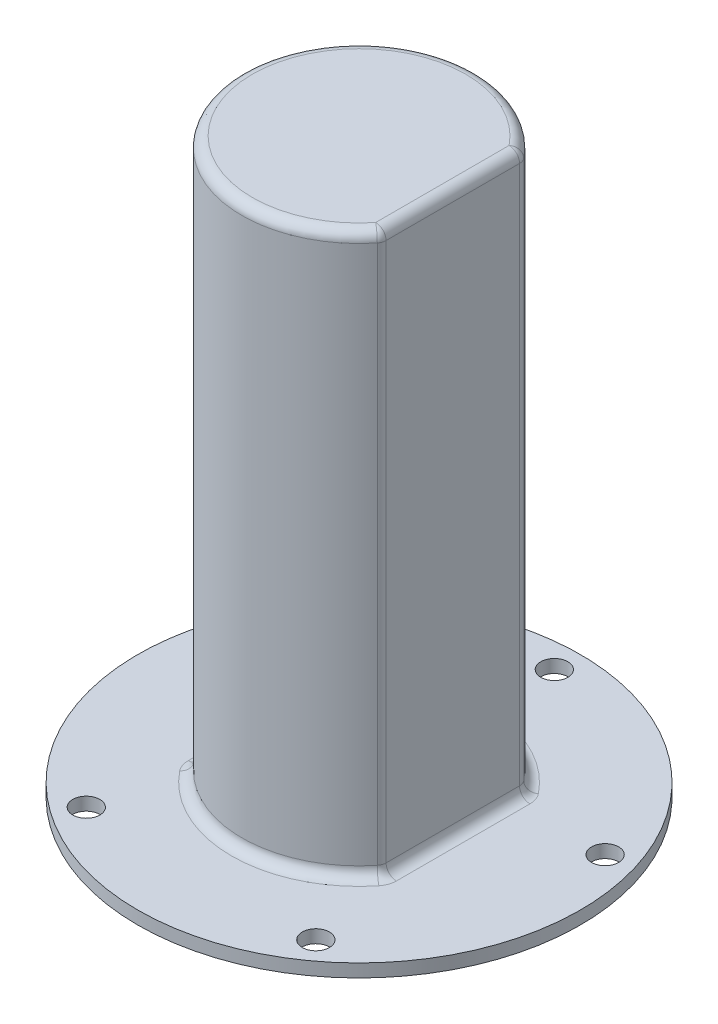
ISO-10303-21;
HEADER;
FILE_DESCRIPTION(('STEP AP214'),'2;1');
FILE_NAME('part.step','',(''),(''),'','','');
FILE_SCHEMA(('AUTOMOTIVE_DESIGN { 1 0 10303 214 1 1 1 1 }'));
ENDSEC;
DATA;
#1=APPLICATION_CONTEXT('core data for automotive mechanical design processes');
#2=APPLICATION_PROTOCOL_DEFINITION('international standard','automotive_design',2000,#1);
#3=PRODUCT_CONTEXT('',#1,'mechanical');
#4=PRODUCT('Part','Part','',(#3));
#5=PRODUCT_RELATED_PRODUCT_CATEGORY('part','',(#4));
#6=PRODUCT_DEFINITION_FORMATION('','',#4);
#7=PRODUCT_DEFINITION_CONTEXT('part definition',#1,'design');
#8=PRODUCT_DEFINITION('design','',#6,#7);
#9=PRODUCT_DEFINITION_SHAPE('','',#8);
#10=(LENGTH_UNIT() NAMED_UNIT(*) SI_UNIT(.MILLI.,.METRE.));
#11=(NAMED_UNIT(*) PLANE_ANGLE_UNIT() SI_UNIT($,.RADIAN.));
#12=(NAMED_UNIT(*) SI_UNIT($,.STERADIAN.) SOLID_ANGLE_UNIT());
#13=UNCERTAINTY_MEASURE_WITH_UNIT(LENGTH_MEASURE(1.E-05),#10,'distance_accuracy_value','');
#14=(GEOMETRIC_REPRESENTATION_CONTEXT(3) GLOBAL_UNCERTAINTY_ASSIGNED_CONTEXT((#13)) GLOBAL_UNIT_ASSIGNED_CONTEXT((#10,
#11,#12)) REPRESENTATION_CONTEXT('',''));
#15=CARTESIAN_POINT('',(0.,0.,0.));
#16=DIRECTION('',(0.,0.,1.));
#17=DIRECTION('',(1.,0.,0.));
#18=AXIS2_PLACEMENT_3D('',#15,#16,#17);
#19=CARTESIAN_POINT('',(0.,3.175,0.));
#20=DIRECTION('',(0.,1.,0.));
#21=DIRECTION('',(0.,0.,1.));
#22=AXIS2_PLACEMENT_3D('',#19,#20,#21);
#23=PLANE('',#22);
#24=CARTESIAN_POINT('',(45.2940665885567,3.175,-14.7169343571067));
#25=DIRECTION('',(0.,1.,0.));
#26=DIRECTION('',(0.,0.,1.));
#27=AXIS2_PLACEMENT_3D('',#24,#25,#26);
#28=CIRCLE('',#27,3.302);
#29=CARTESIAN_POINT('',(45.2940665885567,3.175,-11.4149343571067));
#30=VERTEX_POINT('',#29);
#31=EDGE_CURVE('E163',#30,#30,#28,.T.);
#32=ORIENTED_EDGE('',*,*,#31,.F.);
#33=EDGE_LOOP('',(#32));
#34=FACE_BOUND('',#33,.T.);
#35=CARTESIAN_POINT('',(0.,3.175,0.));
#36=DIRECTION('',(0.,1.,0.));
#37=DIRECTION('',(0.,0.,1.));
#38=AXIS2_PLACEMENT_3D('',#35,#36,#37);
#39=CIRCLE('',#38,53.975);
#40=CARTESIAN_POINT('',(0.,3.175,53.975));
#41=VERTEX_POINT('',#40);
#42=EDGE_CURVE('E175',#41,#41,#39,.T.);
#43=ORIENTED_EDGE('',*,*,#42,.T.);
#44=EDGE_LOOP('',(#43));
#45=FACE_BOUND('',#44,.T.);
#46=CARTESIAN_POINT('',(27.9932726404288,3.175,38.529434357107));
#47=DIRECTION('',(0.,1.,0.));
#48=DIRECTION('',(0.,0.,1.));
#49=AXIS2_PLACEMENT_3D('',#46,#47,#48);
#50=CIRCLE('',#49,3.302);
#51=CARTESIAN_POINT('',(27.9932726404288,3.175,41.831434357107));
#52=VERTEX_POINT('',#51);
#53=EDGE_CURVE('E157',#52,#52,#50,.T.);
#54=ORIENTED_EDGE('',*,*,#53,.F.);
#55=EDGE_LOOP('',(#54));
#56=FACE_BOUND('',#55,.T.);
#57=CARTESIAN_POINT('',(0.,3.175,-47.625));
#58=DIRECTION('',(0.,1.,0.));
#59=DIRECTION('',(0.,0.,1.));
#60=AXIS2_PLACEMENT_3D('',#57,#58,#59);
#61=CIRCLE('',#60,3.302);
#62=CARTESIAN_POINT('',(0.,3.175,-44.323));
#63=VERTEX_POINT('',#62);
#64=EDGE_CURVE('E169',#63,#63,#61,.T.);
#65=ORIENTED_EDGE('',*,*,#64,.F.);
#66=EDGE_LOOP('',(#65));
#67=FACE_BOUND('',#66,.T.);
#68=CARTESIAN_POINT('',(-27.9932726404294,3.175,38.5294343571066));
#69=DIRECTION('',(0.,1.,0.));
#70=DIRECTION('',(0.,0.,1.));
#71=AXIS2_PLACEMENT_3D('',#68,#69,#70);
#72=CIRCLE('',#71,3.302);
#73=CARTESIAN_POINT('',(-27.9932726404294,3.175,41.8314343571066));
#74=VERTEX_POINT('',#73);
#75=EDGE_CURVE('E147',#74,#74,#72,.T.);
#76=ORIENTED_EDGE('',*,*,#75,.F.);
#77=EDGE_LOOP('',(#76));
#78=FACE_BOUND('',#77,.T.);
#79=CARTESIAN_POINT('',(-45.2940665885565,3.175,-14.7169343571074));
#80=DIRECTION('',(0.,1.,0.));
#81=DIRECTION('',(0.,0.,1.));
#82=AXIS2_PLACEMENT_3D('',#79,#80,#81);
#83=CIRCLE('',#82,3.302);
#84=CARTESIAN_POINT('',(-47.5318559517014,3.175,-17.145));
#85=VERTEX_POINT('',#84);
#86=EDGE_CURVE('E140',#85,#85,#83,.T.);
#87=ORIENTED_EDGE('',*,*,#86,.F.);
#88=EDGE_LOOP('',(#87));
#89=FACE_BOUND('',#88,.T.);
#90=CARTESIAN_POINT('',(20.32,3.175,-16.2763271348299));
#91=DIRECTION('',(0.,1.,0.));
#92=DIRECTION('',(0.,0.,1.));
#93=AXIS2_PLACEMENT_3D('',#90,#91,#92);
#94=CIRCLE('',#93,5.08);
#95=CARTESIAN_POINT('',(25.4,3.175,-16.2763271348299));
#96=VERTEX_POINT('',#95);
#97=CARTESIAN_POINT('',(24.2848780487805,3.175,-19.452195844065));
#98=VERTEX_POINT('',#97);
#99=EDGE_CURVE('E215',#96,#98,#94,.T.);
#100=ORIENTED_EDGE('',*,*,#99,.F.);
#101=DIRECTION('',(0.,0.,-1.));
#102=VECTOR('',#101,1.);
#103=CARTESIAN_POINT('',(25.4,3.175,0.));
#104=LINE('',#103,#102);
#105=CARTESIAN_POINT('',(25.4,3.175,16.2763271348299));
#106=VERTEX_POINT('',#105);
#107=EDGE_CURVE('E213',#96,#106,#104,.F.);
#108=ORIENTED_EDGE('',*,*,#107,.T.);
#109=CARTESIAN_POINT('',(20.32,3.175,16.2763271348299));
#110=DIRECTION('',(0.,1.,0.));
#111=DIRECTION('',(0.,0.,1.));
#112=AXIS2_PLACEMENT_3D('',#109,#110,#111);
#113=CIRCLE('',#112,5.08);
#114=CARTESIAN_POINT('',(24.2848780487805,3.175,19.452195844065));
#115=VERTEX_POINT('',#114);
#116=EDGE_CURVE('E210',#115,#106,#113,.T.);
#117=ORIENTED_EDGE('',*,*,#116,.F.);
#118=CARTESIAN_POINT('',(0.,3.175,0.));
#119=DIRECTION('',(0.,1.,0.));
#120=DIRECTION('',(0.,0.,1.));
#121=AXIS2_PLACEMENT_3D('',#118,#119,#120);
#122=CIRCLE('',#121,31.115);
#123=CARTESIAN_POINT('',(-24.2848780487805,3.175,19.452195844065));
#124=VERTEX_POINT('',#123);
#125=EDGE_CURVE('E207',#115,#124,#122,.F.);
#126=ORIENTED_EDGE('',*,*,#125,.T.);
#127=CARTESIAN_POINT('',(-20.32,3.175,16.2763271348299));
#128=DIRECTION('',(0.,1.,0.));
#129=DIRECTION('',(0.,0.,1.));
#130=AXIS2_PLACEMENT_3D('',#127,#128,#129);
#131=CIRCLE('',#130,5.08);
#132=CARTESIAN_POINT('',(-25.4,3.175,16.2763271348299));
#133=VERTEX_POINT('',#132);
#134=EDGE_CURVE('E204',#133,#124,#131,.T.);
#135=ORIENTED_EDGE('',*,*,#134,.F.);
#136=DIRECTION('',(0.,0.,-1.));
#137=VECTOR('',#136,1.);
#138=CARTESIAN_POINT('',(-25.4,3.175,-17.145));
#139=LINE('',#138,#137);
#140=CARTESIAN_POINT('',(-25.4,3.175,-16.2763271348299));
#141=VERTEX_POINT('',#140);
#142=EDGE_CURVE('E200',#133,#141,#139,.T.);
#143=ORIENTED_EDGE('',*,*,#142,.T.);
#144=CARTESIAN_POINT('',(-20.32,3.175,-16.2763271348299));
#145=DIRECTION('',(0.,1.,0.));
#146=DIRECTION('',(0.,0.,1.));
#147=AXIS2_PLACEMENT_3D('',#144,#145,#146);
#148=CIRCLE('',#147,5.08);
#149=CARTESIAN_POINT('',(-24.2848780487805,3.175,-19.452195844065));
#150=VERTEX_POINT('',#149);
#151=EDGE_CURVE('E197',#150,#141,#148,.T.);
#152=ORIENTED_EDGE('',*,*,#151,.F.);
#153=CARTESIAN_POINT('',(0.,3.175,0.));
#154=DIRECTION('',(0.,1.,0.));
#155=DIRECTION('',(0.,0.,1.));
#156=AXIS2_PLACEMENT_3D('',#153,#154,#155);
#157=CIRCLE('',#156,31.115);
#158=EDGE_CURVE('E202',#150,#98,#157,.F.);
#159=ORIENTED_EDGE('',*,*,#158,.T.);
#160=EDGE_LOOP('',(#100,#108,#117,#126,#135,#143,#152,#159));
#161=FACE_BOUND('',#160,.T.);
#162=ADVANCED_FACE('F35',(#34,#45,#56,#67,#78,#89,#161),#23,.T.);
#163=CARTESIAN_POINT('',(0.,139.7,0.));
#164=DIRECTION('',(0.,-1.,0.));
#165=DIRECTION('',(0.,0.,-1.));
#166=AXIS2_PLACEMENT_3D('',#163,#164,#165);
#167=CYLINDRICAL_SURFACE('',#166,28.575);
#168=DIRECTION('',(0.,-1.,0.));
#169=VECTOR('',#168,1.);
#170=CARTESIAN_POINT('',(-22.3024390243902,139.7,-17.8642614894475));
#171=LINE('',#170,#169);
#172=CARTESIAN_POINT('',(-22.3024390243902,5.715,-17.8642614894475));
#173=VERTEX_POINT('',#172);
#174=CARTESIAN_POINT('',(-22.3024390243902,55.245,-17.8642614894475));
#175=VERTEX_POINT('',#174);
#176=EDGE_CURVE('E191',#173,#175,#171,.F.);
#177=ORIENTED_EDGE('',*,*,#176,.T.);
#178=CARTESIAN_POINT('',(0.,55.245,0.));
#179=DIRECTION('',(0.,1.,0.));
#180=DIRECTION('',(0.,0.,1.));
#181=AXIS2_PLACEMENT_3D('',#178,#179,#180);
#182=CIRCLE('',#181,28.575);
#183=CARTESIAN_POINT('',(-22.3024390243902,55.245,17.8642614894475));
#184=VERTEX_POINT('',#183);
#185=EDGE_CURVE('E195',#175,#184,#182,.T.);
#186=ORIENTED_EDGE('',*,*,#185,.T.);
#187=DIRECTION('',(0.,-1.,0.));
#188=VECTOR('',#187,1.);
#189=CARTESIAN_POINT('',(-22.3024390243902,139.7,17.8642614894475));
#190=LINE('',#189,#188);
#191=CARTESIAN_POINT('',(-22.3024390243902,5.715,17.8642614894475));
#192=VERTEX_POINT('',#191);
#193=EDGE_CURVE('E193',#184,#192,#190,.T.);
#194=ORIENTED_EDGE('',*,*,#193,.T.);
#195=CARTESIAN_POINT('',(0.,5.715,0.));
#196=DIRECTION('',(0.,1.,0.));
#197=DIRECTION('',(0.,0.,1.));
#198=AXIS2_PLACEMENT_3D('',#195,#196,#197);
#199=CIRCLE('',#198,28.575);
#200=CARTESIAN_POINT('',(22.3024390243902,5.715,17.8642614894475));
#201=VERTEX_POINT('',#200);
#202=EDGE_CURVE('E188',#192,#201,#199,.T.);
#203=ORIENTED_EDGE('',*,*,#202,.T.);
#204=DIRECTION('',(0.,-1.,0.));
#205=VECTOR('',#204,1.);
#206=CARTESIAN_POINT('',(22.3024390243902,139.7,17.8642614894475));
#207=LINE('',#206,#205);
#208=CARTESIAN_POINT('',(22.3024390243902,137.16,17.8642614894475));
#209=VERTEX_POINT('',#208);
#210=EDGE_CURVE('E184',#201,#209,#207,.F.);
#211=ORIENTED_EDGE('',*,*,#210,.T.);
#212=CARTESIAN_POINT('',(0.,137.16,0.));
#213=DIRECTION('',(0.,1.,0.));
#214=DIRECTION('',(0.,0.,1.));
#215=AXIS2_PLACEMENT_3D('',#212,#213,#214);
#216=CIRCLE('',#215,28.575);
#217=CARTESIAN_POINT('',(22.3024390243902,137.16,-17.8642614894475));
#218=VERTEX_POINT('',#217);
#219=EDGE_CURVE('E178',#209,#218,#216,.F.);
#220=ORIENTED_EDGE('',*,*,#219,.T.);
#221=DIRECTION('',(0.,-1.,0.));
#222=VECTOR('',#221,1.);
#223=CARTESIAN_POINT('',(22.3024390243902,139.7,-17.8642614894475));
#224=LINE('',#223,#222);
#225=CARTESIAN_POINT('',(22.3024390243902,5.715,-17.8642614894475));
#226=VERTEX_POINT('',#225);
#227=EDGE_CURVE('E182',#218,#226,#224,.T.);
#228=ORIENTED_EDGE('',*,*,#227,.T.);
#229=CARTESIAN_POINT('',(0.,5.715,0.));
#230=DIRECTION('',(0.,1.,0.));
#231=DIRECTION('',(0.,0.,1.));
#232=AXIS2_PLACEMENT_3D('',#229,#230,#231);
#233=CIRCLE('',#232,28.575);
#234=EDGE_CURVE('E186',#226,#173,#233,.T.);
#235=ORIENTED_EDGE('',*,*,#234,.T.);
#236=EDGE_LOOP('',(#177,#186,#194,#203,#211,#220,#228,#235));
#237=FACE_BOUND('',#236,.T.);
#238=ADVANCED_FACE('F267',(#237),#167,.T.);
#239=CARTESIAN_POINT('',(0.,0.,0.));
#240=DIRECTION('',(0.,1.,0.));
#241=DIRECTION('',(0.,0.,1.));
#242=AXIS2_PLACEMENT_3D('',#239,#240,#241);
#243=PLANE('',#242);
#244=CARTESIAN_POINT('',(-27.9932726404294,0.,38.5294343571066));
#245=DIRECTION('',(0.,1.,0.));
#246=DIRECTION('',(0.,0.,1.));
#247=AXIS2_PLACEMENT_3D('',#244,#245,#246);
#248=CIRCLE('',#247,3.302);
#249=CARTESIAN_POINT('',(-27.9932726404294,0.,41.8314343571066));
#250=VERTEX_POINT('',#249);
#251=EDGE_CURVE('E143',#250,#250,#248,.T.);
#252=ORIENTED_EDGE('',*,*,#251,.T.);
#253=EDGE_LOOP('',(#252));
#254=FACE_BOUND('',#253,.T.);
#255=CARTESIAN_POINT('',(45.2940665885567,0.,-14.7169343571067));
#256=DIRECTION('',(0.,1.,0.));
#257=DIRECTION('',(0.,0.,1.));
#258=AXIS2_PLACEMENT_3D('',#255,#256,#257);
#259=CIRCLE('',#258,3.302);
#260=CARTESIAN_POINT('',(45.2940665885567,0.,-11.4149343571067));
#261=VERTEX_POINT('',#260);
#262=EDGE_CURVE('E160',#261,#261,#259,.T.);
#263=ORIENTED_EDGE('',*,*,#262,.T.);
#264=EDGE_LOOP('',(#263));
#265=FACE_BOUND('',#264,.T.);
#266=CARTESIAN_POINT('',(0.,0.,0.));
#267=DIRECTION('',(0.,1.,0.));
#268=DIRECTION('',(0.,0.,1.));
#269=AXIS2_PLACEMENT_3D('',#266,#267,#268);
#270=CIRCLE('',#269,53.975);
#271=CARTESIAN_POINT('',(0.,0.,53.975));
#272=VERTEX_POINT('',#271);
#273=EDGE_CURVE('E172',#272,#272,#270,.T.);
#274=ORIENTED_EDGE('',*,*,#273,.F.);
#275=EDGE_LOOP('',(#274));
#276=FACE_BOUND('',#275,.T.);
#277=CARTESIAN_POINT('',(0.,0.,-47.625));
#278=DIRECTION('',(0.,1.,0.));
#279=DIRECTION('',(0.,0.,1.));
#280=AXIS2_PLACEMENT_3D('',#277,#278,#279);
#281=CIRCLE('',#280,3.302);
#282=CARTESIAN_POINT('',(0.,0.,-44.323));
#283=VERTEX_POINT('',#282);
#284=EDGE_CURVE('E166',#283,#283,#281,.T.);
#285=ORIENTED_EDGE('',*,*,#284,.T.);
#286=EDGE_LOOP('',(#285));
#287=FACE_BOUND('',#286,.T.);
#288=CARTESIAN_POINT('',(27.9932726404288,0.,38.529434357107));
#289=DIRECTION('',(0.,1.,0.));
#290=DIRECTION('',(0.,0.,1.));
#291=AXIS2_PLACEMENT_3D('',#288,#289,#290);
#292=CIRCLE('',#291,3.302);
#293=CARTESIAN_POINT('',(27.9932726404288,0.,41.831434357107));
#294=VERTEX_POINT('',#293);
#295=EDGE_CURVE('E155',#294,#294,#292,.T.);
#296=ORIENTED_EDGE('',*,*,#295,.T.);
#297=EDGE_LOOP('',(#296));
#298=FACE_BOUND('',#297,.T.);
#299=CARTESIAN_POINT('',(-45.2940665885565,0.,-14.7169343571074));
#300=DIRECTION('',(0.,1.,0.));
#301=DIRECTION('',(0.,0.,1.));
#302=AXIS2_PLACEMENT_3D('',#299,#300,#301);
#303=CIRCLE('',#302,3.302);
#304=CARTESIAN_POINT('',(-45.2940665885565,0.,-11.4149343571074));
#305=VERTEX_POINT('',#304);
#306=EDGE_CURVE('E144',#305,#305,#303,.T.);
#307=ORIENTED_EDGE('',*,*,#306,.T.);
#308=EDGE_LOOP('',(#307));
#309=FACE_BOUND('',#308,.T.);
#310=ADVANCED_FACE('F270',(#254,#265,#276,#287,#298,#309),#243,.F.);
#311=CARTESIAN_POINT('',(0.,3.175,0.));
#312=DIRECTION('',(0.,-1.,0.));
#313=DIRECTION('',(0.,0.,-1.));
#314=AXIS2_PLACEMENT_3D('',#311,#312,#313);
#315=CYLINDRICAL_SURFACE('',#314,53.975);
#316=ORIENTED_EDGE('',*,*,#42,.F.);
#317=EDGE_LOOP('',(#316));
#318=FACE_BOUND('',#317,.T.);
#319=ORIENTED_EDGE('',*,*,#273,.T.);
#320=EDGE_LOOP('',(#319));
#321=FACE_BOUND('',#320,.T.);
#322=ADVANCED_FACE('F289',(#318,#321),#315,.T.);
#323=CARTESIAN_POINT('',(0.,3.175,-47.625));
#324=DIRECTION('',(0.,-1.,0.));
#325=DIRECTION('',(0.,0.,-1.));
#326=AXIS2_PLACEMENT_3D('',#323,#324,#325);
#327=CYLINDRICAL_SURFACE('',#326,3.302);
#328=ORIENTED_EDGE('',*,*,#64,.T.);
#329=EDGE_LOOP('',(#328));
#330=FACE_BOUND('',#329,.T.);
#331=ORIENTED_EDGE('',*,*,#284,.F.);
#332=EDGE_LOOP('',(#331));
#333=FACE_BOUND('',#332,.T.);
#334=ADVANCED_FACE('F285',(#330,#333),#327,.F.);
#335=CARTESIAN_POINT('',(45.2940665885567,3.175,-14.7169343571067));
#336=DIRECTION('',(0.,-1.,0.));
#337=DIRECTION('',(0.,0.,-1.));
#338=AXIS2_PLACEMENT_3D('',#335,#336,#337);
#339=CYLINDRICAL_SURFACE('',#338,3.302);
#340=ORIENTED_EDGE('',*,*,#31,.T.);
#341=EDGE_LOOP('',(#340));
#342=FACE_BOUND('',#341,.T.);
#343=ORIENTED_EDGE('',*,*,#262,.F.);
#344=EDGE_LOOP('',(#343));
#345=FACE_BOUND('',#344,.T.);
#346=ADVANCED_FACE('F281',(#342,#345),#339,.F.);
#347=CARTESIAN_POINT('',(27.9932726404288,3.175,38.529434357107));
#348=DIRECTION('',(0.,-1.,0.));
#349=DIRECTION('',(0.,0.,-1.));
#350=AXIS2_PLACEMENT_3D('',#347,#348,#349);
#351=CYLINDRICAL_SURFACE('',#350,3.302);
#352=ORIENTED_EDGE('',*,*,#53,.T.);
#353=EDGE_LOOP('',(#352));
#354=FACE_BOUND('',#353,.T.);
#355=ORIENTED_EDGE('',*,*,#295,.F.);
#356=EDGE_LOOP('',(#355));
#357=FACE_BOUND('',#356,.T.);
#358=ADVANCED_FACE('F277',(#354,#357),#351,.F.);
#359=CARTESIAN_POINT('',(-27.9932726404294,3.175,38.5294343571066));
#360=DIRECTION('',(0.,-1.,0.));
#361=DIRECTION('',(0.,0.,-1.));
#362=AXIS2_PLACEMENT_3D('',#359,#360,#361);
#363=CYLINDRICAL_SURFACE('',#362,3.302);
#364=ORIENTED_EDGE('',*,*,#75,.T.);
#365=EDGE_LOOP('',(#364));
#366=FACE_BOUND('',#365,.T.);
#367=ORIENTED_EDGE('',*,*,#251,.F.);
#368=EDGE_LOOP('',(#367));
#369=FACE_BOUND('',#368,.T.);
#370=ADVANCED_FACE('F274',(#366,#369),#363,.F.);
#371=CARTESIAN_POINT('',(-45.2940665885565,3.175,-14.7169343571074));
#372=DIRECTION('',(0.,-1.,0.));
#373=DIRECTION('',(0.,0.,-1.));
#374=AXIS2_PLACEMENT_3D('',#371,#372,#373);
#375=CYLINDRICAL_SURFACE('',#374,3.302);
#376=ORIENTED_EDGE('',*,*,#86,.T.);
#377=EDGE_LOOP('',(#376));
#378=FACE_BOUND('',#377,.T.);
#379=ORIENTED_EDGE('',*,*,#306,.F.);
#380=EDGE_LOOP('',(#379));
#381=FACE_BOUND('',#380,.T.);
#382=ADVANCED_FACE('F265',(#378,#381),#375,.F.);
#383=CARTESIAN_POINT('',(0.,139.7,0.));
#384=DIRECTION('',(0.,1.,0.));
#385=DIRECTION('',(0.,0.,1.));
#386=AXIS2_PLACEMENT_3D('',#383,#384,#385);
#387=PLANE('',#386);
#388=CARTESIAN_POINT('',(0.,139.7,0.));
#389=DIRECTION('',(0.,1.,0.));
#390=DIRECTION('',(0.,0.,1.));
#391=AXIS2_PLACEMENT_3D('',#388,#389,#390);
#392=CIRCLE('',#391,26.035);
#393=CARTESIAN_POINT('',(20.32,139.7,-16.2763271348299));
#394=VERTEX_POINT('',#393);
#395=CARTESIAN_POINT('',(20.32,139.7,16.2763271348299));
#396=VERTEX_POINT('',#395);
#397=EDGE_CURVE('E233',#394,#396,#392,.T.);
#398=ORIENTED_EDGE('',*,*,#397,.T.);
#399=DIRECTION('',(0.,0.,1.));
#400=VECTOR('',#399,1.);
#401=CARTESIAN_POINT('',(20.32,139.7,-17.145));
#402=LINE('',#401,#400);
#403=EDGE_CURVE('E235',#396,#394,#402,.F.);
#404=ORIENTED_EDGE('',*,*,#403,.T.);
#405=EDGE_LOOP('',(#398,#404));
#406=FACE_BOUND('',#405,.T.);
#407=ADVANCED_FACE('F261',(#406),#387,.T.);
#408=CARTESIAN_POINT('',(22.86,-49.8540887247113,-17.145));
#409=DIRECTION('',(-1.,0.,0.));
#410=DIRECTION('',(0.,0.,1.));
#411=AXIS2_PLACEMENT_3D('',#408,#409,#410);
#412=PLANE('',#411);
#413=DIRECTION('',(0.,-1.,0.));
#414=VECTOR('',#413,1.);
#415=CARTESIAN_POINT('',(22.86,-49.8540887247113,16.2763271348299));
#416=LINE('',#415,#414);
#417=CARTESIAN_POINT('',(22.86,137.16,16.2763271348299));
#418=VERTEX_POINT('',#417);
#419=CARTESIAN_POINT('',(22.86,5.715,16.2763271348299));
#420=VERTEX_POINT('',#419);
#421=EDGE_CURVE('E222',#418,#420,#416,.T.);
#422=ORIENTED_EDGE('',*,*,#421,.T.);
#423=DIRECTION('',(0.,0.,-1.));
#424=VECTOR('',#423,1.);
#425=CARTESIAN_POINT('',(22.86,5.715,-17.145));
#426=LINE('',#425,#424);
#427=CARTESIAN_POINT('',(22.86,5.715,-16.2763271348299));
#428=VERTEX_POINT('',#427);
#429=EDGE_CURVE('E225',#420,#428,#426,.T.);
#430=ORIENTED_EDGE('',*,*,#429,.T.);
#431=DIRECTION('',(0.,-1.,0.));
#432=VECTOR('',#431,1.);
#433=CARTESIAN_POINT('',(22.86,-49.8540887247113,-16.2763271348299));
#434=LINE('',#433,#432);
#435=CARTESIAN_POINT('',(22.86,137.16,-16.2763271348299));
#436=VERTEX_POINT('',#435);
#437=EDGE_CURVE('E220',#428,#436,#434,.F.);
#438=ORIENTED_EDGE('',*,*,#437,.T.);
#439=DIRECTION('',(0.,0.,1.));
#440=VECTOR('',#439,1.);
#441=CARTESIAN_POINT('',(22.86,137.16,17.145));
#442=LINE('',#441,#440);
#443=EDGE_CURVE('E218',#436,#418,#442,.T.);
#444=ORIENTED_EDGE('',*,*,#443,.T.);
#445=EDGE_LOOP('',(#422,#430,#438,#444));
#446=FACE_BOUND('',#445,.T.);
#447=ADVANCED_FACE('F257',(#446),#412,.F.);
#448=CARTESIAN_POINT('',(-22.86,52.705,-17.145));
#449=DIRECTION('',(0.,1.,0.));
#450=DIRECTION('',(0.,0.,1.));
#451=AXIS2_PLACEMENT_3D('',#448,#449,#450);
#452=PLANE('',#451);
#453=DIRECTION('',(0.,0.,-1.));
#454=VECTOR('',#453,1.);
#455=CARTESIAN_POINT('',(-22.86,52.705,17.145));
#456=LINE('',#455,#454);
#457=CARTESIAN_POINT('',(-22.86,52.705,12.4595997126714));
#458=VERTEX_POINT('',#457);
#459=CARTESIAN_POINT('',(-22.86,52.705,-12.4595997126714));
#460=VERTEX_POINT('',#459);
#461=EDGE_CURVE('E150',#458,#460,#456,.T.);
#462=ORIENTED_EDGE('',*,*,#461,.F.);
#463=CARTESIAN_POINT('',(0.,52.705,0.));
#464=DIRECTION('',(0.,1.,0.));
#465=DIRECTION('',(0.,0.,1.));
#466=AXIS2_PLACEMENT_3D('',#463,#464,#465);
#467=CIRCLE('',#466,26.035);
#468=EDGE_CURVE('E231',#458,#460,#467,.F.);
#469=ORIENTED_EDGE('',*,*,#468,.T.);
#470=EDGE_LOOP('',(#462,#469));
#471=FACE_BOUND('',#470,.T.);
#472=ADVANCED_FACE('F256',(#471),#452,.F.);
#473=CARTESIAN_POINT('',(-22.86,52.705,17.145));
#474=DIRECTION('',(-1.,0.,0.));
#475=DIRECTION('',(0.,0.,1.));
#476=AXIS2_PLACEMENT_3D('',#473,#474,#475);
#477=PLANE('',#476);
#478=DIRECTION('',(0.,0.,-1.));
#479=VECTOR('',#478,1.);
#480=CARTESIAN_POINT('',(-22.86,5.715,17.145));
#481=LINE('',#480,#479);
#482=CARTESIAN_POINT('',(-22.86,5.715,-16.2763271348299));
#483=VERTEX_POINT('',#482);
#484=CARTESIAN_POINT('',(-22.86,5.715,16.2763271348299));
#485=VERTEX_POINT('',#484);
#486=EDGE_CURVE('E227',#483,#485,#481,.F.);
#487=ORIENTED_EDGE('',*,*,#486,.T.);
#488=DIRECTION('',(0.,1.,0.));
#489=VECTOR('',#488,1.);
#490=CARTESIAN_POINT('',(-22.86,52.705,16.2763271348299));
#491=LINE('',#490,#489);
#492=CARTESIAN_POINT('',(-22.86,53.7148889718676,16.2763271348299));
#493=VERTEX_POINT('',#492);
#494=EDGE_CURVE('E59',#485,#493,#491,.T.);
#495=ORIENTED_EDGE('',*,*,#494,.T.);
#496=CARTESIAN_POINT('',(-22.86,53.7148889718676,16.2763271348299));
#497=CARTESIAN_POINT('',(-22.86,53.6487930234453,16.1902372081156));
#498=CARTESIAN_POINT('',(-22.86,53.5871477468965,16.1009054826724));
#499=CARTESIAN_POINT('',(-22.86,53.4721272197603,15.9173267465466));
#500=CARTESIAN_POINT('',(-22.86,53.4187335439354,15.8230913338566));
#501=CARTESIAN_POINT('',(-22.86,53.3197287103974,15.6317146647151));
#502=CARTESIAN_POINT('',(-22.86,53.274053351273,15.5346061773248));
#503=CARTESIAN_POINT('',(-22.86,53.1892221177303,15.3375179652356));
#504=CARTESIAN_POINT('',(-22.86,53.1500712014421,15.2375361240201));
#505=CARTESIAN_POINT('',(-22.86,53.0502058565037,14.9586228564543));
#506=CARTESIAN_POINT('',(-22.86,52.9957224056959,14.777450184126));
#507=CARTESIAN_POINT('',(-22.86,52.9024449867066,14.4111310327568));
#508=CARTESIAN_POINT('',(-22.86,52.8636595974683,14.2259824389285));
#509=CARTESIAN_POINT('',(-22.86,52.7994977688017,13.8524295408811));
#510=CARTESIAN_POINT('',(-22.86,52.7741919108979,13.6640133320838));
#511=CARTESIAN_POINT('',(-22.86,52.7355841129382,13.2860579898239));
#512=CARTESIAN_POINT('',(-22.86,52.7222772856261,13.0965193452261));
#513=CARTESIAN_POINT('',(-22.86,52.7111367125791,12.8321487208941));
#514=CARTESIAN_POINT('',(-22.86,52.7088134135355,12.7574773473628));
#515=CARTESIAN_POINT('',(-22.86,52.7057485245502,12.6084048824526));
#516=CARTESIAN_POINT('',(-22.86,52.7050005577692,12.5340039231627));
#517=CARTESIAN_POINT('',(-22.86,52.705,12.4595997126714));
#518=B_SPLINE_CURVE_WITH_KNOTS('',3,(#496,#497,#498,#499,#500,#501,#502,#503,#504,#505,#506,
#507,#508,#509,#510,#511,#512,#513,#514,#515,#516,#517),.UNSPECIFIED.,.F.,.F.,(4,2,2,2,2,2,2,2,
2,2,4),(0.,0.325268623349181,0.649800110980248,0.971482831565672,1.2934089051353,1.86004695823,
2.42699426053714,2.99688173486904,3.56653698662341,3.79064749587216,4.01384906336379),.UNSPECIFIED.);
#519=EDGE_CURVE('E44',#493,#458,#518,.T.);
#520=ORIENTED_EDGE('',*,*,#519,.T.);
#521=ORIENTED_EDGE('',*,*,#461,.T.);
#522=CARTESIAN_POINT('',(-22.86,52.705,-12.4595997126714));
#523=CARTESIAN_POINT('',(-22.86,52.7050039301598,-12.5685470200766));
#524=CARTESIAN_POINT('',(-22.86,52.7066050185867,-12.6774895046259));
#525=CARTESIAN_POINT('',(-22.86,52.7132285847598,-12.8952971848967));
#526=CARTESIAN_POINT('',(-22.86,52.718251939971,-13.0041623536266));
#527=CARTESIAN_POINT('',(-22.86,52.7388411093877,-13.3311881512017));
#528=CARTESIAN_POINT('',(-22.86,52.7599291349954,-13.5490446938378));
#529=CARTESIAN_POINT('',(-22.86,52.8180710464484,-13.9749953058629));
#530=CARTESIAN_POINT('',(-22.86,52.8545491685449,-14.1831669247415));
#531=CARTESIAN_POINT('',(-22.86,52.9459988542151,-14.5953003994115));
#532=CARTESIAN_POINT('',(-22.86,53.0009466604502,-14.7992673077677));
#533=CARTESIAN_POINT('',(-22.86,53.1040025230701,-15.1123654127273));
#534=CARTESIAN_POINT('',(-22.86,53.1446018134312,-15.2239795258793));
#535=CARTESIAN_POINT('',(-22.86,53.2335264948635,-15.4440150553648));
#536=CARTESIAN_POINT('',(-22.86,53.2818458354746,-15.5524388938636));
#537=CARTESIAN_POINT('',(-22.86,53.3881300143107,-15.7671132202723));
#538=CARTESIAN_POINT('',(-22.86,53.4462616563671,-15.8732824792673));
#539=CARTESIAN_POINT('',(-22.86,53.5410163082377,-16.0280871202263));
#540=CARTESIAN_POINT('',(-22.86,53.5739129396696,-16.0790164096951));
#541=CARTESIAN_POINT('',(-22.86,53.6423698633024,-16.1790880004356));
#542=CARTESIAN_POINT('',(-22.86,53.6779315274699,-16.2282293616702));
#543=CARTESIAN_POINT('',(-22.86,53.714888971867,-16.2763271348301));
#544=B_SPLINE_CURVE_WITH_KNOTS('',3,(#522,#523,#524,#525,#526,#527,#528,#529,#530,#531,#532,
#533,#534,#535,#536,#537,#538,#539,#540,#541,#542,#543),.UNSPECIFIED.,.F.,.F.,(4,2,2,2,2,2,2,2,
2,2,4),(0.,0.326816648397707,0.653717123737571,1.30971716291742,1.94309116745,2.57565356836844,
2.93171848958237,3.28750570754432,3.65009768656941,3.83191182436487,4.01382021222101),.UNSPECIFIED.);
#545=CARTESIAN_POINT('',(-22.86,53.7148889718676,-16.2763271348299));
#546=VERTEX_POINT('',#545);
#547=EDGE_CURVE('E11',#460,#546,#544,.T.);
#548=ORIENTED_EDGE('',*,*,#547,.T.);
#549=DIRECTION('',(0.,1.,0.));
#550=VECTOR('',#549,1.);
#551=CARTESIAN_POINT('',(-22.86,3.17500000000001,-16.2763271348299));
#552=LINE('',#551,#550);
#553=EDGE_CURVE('E52',#546,#483,#552,.F.);
#554=ORIENTED_EDGE('',*,*,#553,.T.);
#555=EDGE_LOOP('',(#487,#495,#520,#521,#548,#554));
#556=FACE_BOUND('',#555,.T.);
#557=ADVANCED_FACE('F251',(#556),#477,.T.);
#558=CARTESIAN_POINT('',(20.32,137.16,-16.2763271348299));
#559=DIRECTION('',(0.,0.,1.));
#560=DIRECTION('',(1.,0.,0.));
#561=AXIS2_PLACEMENT_3D('',#558,#559,#560);
#562=SPHERICAL_SURFACE('',#561,2.54);
#563=CARTESIAN_POINT('',(20.32,137.16,-16.2763271348299));
#564=DIRECTION('',(0.,1.,0.));
#565=DIRECTION('',(0.,0.,1.));
#566=AXIS2_PLACEMENT_3D('',#563,#564,#565);
#567=CIRCLE('',#566,2.54);
#568=EDGE_CURVE('E395',#218,#436,#567,.F.);
#569=ORIENTED_EDGE('',*,*,#568,.F.);
#570=CARTESIAN_POINT('',(20.32,137.16,-16.2763271348299));
#571=DIRECTION('',(0.625171005754941,0.,0.780487804878049));
#572=DIRECTION('',(0.780487804878049,0.,-0.625171005754941));
#573=AXIS2_PLACEMENT_3D('',#570,#571,#572);
#574=CIRCLE('',#573,2.54);
#575=EDGE_CURVE('E39',#394,#218,#574,.F.);
#576=ORIENTED_EDGE('',*,*,#575,.F.);
#577=CARTESIAN_POINT('',(20.32,137.16,-16.2763271348299));
#578=DIRECTION('',(0.,0.,-1.));
#579=DIRECTION('',(-1.,0.,0.));
#580=AXIS2_PLACEMENT_3D('',#577,#578,#579);
#581=CIRCLE('',#580,2.54);
#582=EDGE_CURVE('E393',#436,#394,#581,.F.);
#583=ORIENTED_EDGE('',*,*,#582,.F.);
#584=EDGE_LOOP('',(#569,#576,#583));
#585=FACE_BOUND('',#584,.T.);
#586=ADVANCED_FACE('F37',(#585),#562,.T.);
#587=CARTESIAN_POINT('',(-20.32,139.7,-16.2763271348299));
#588=DIRECTION('',(0.,-1.,0.));
#589=DIRECTION('',(0.,0.,-1.));
#590=AXIS2_PLACEMENT_3D('',#587,#588,#589);
#591=CYLINDRICAL_SURFACE('',#590,2.54);
#592=CARTESIAN_POINT('',(-22.86,53.7148889718676,-16.2763271348299));
#593=CARTESIAN_POINT('',(-22.8599847038696,53.7805851624246,-16.3617995595061));
#594=CARTESIAN_POINT('',(-22.8556866890943,53.8476986617959,-16.4461165655971));
#595=CARTESIAN_POINT('',(-22.8391019497314,53.9841756705187,-16.6120194517251));
#596=CARTESIAN_POINT('',(-22.8268204348436,54.0535376845574,-16.6936070763618));
#597=CARTESIAN_POINT('',(-22.7948753804585,54.1938759270847,-16.8535857034578));
#598=CARTESIAN_POINT('',(-22.7752264187786,54.2648487095421,-16.9319826818177));
#599=CARTESIAN_POINT('',(-22.7290127563649,54.4081152597734,-17.085450495122));
#600=CARTESIAN_POINT('',(-22.7024476336661,54.480409107897,-17.1605211267941));
#601=CARTESIAN_POINT('',(-22.62646945604,54.6658254515413,-17.3472131457588));
#602=CARTESIAN_POINT('',(-22.5725112170502,54.7796249755104,-17.4563358887845));
#603=CARTESIAN_POINT('',(-22.4502968903766,55.0082097647339,-17.6648574845206));
#604=CARTESIAN_POINT('',(-22.3820568834877,55.1229937832493,-17.7642670907883));
#605=CARTESIAN_POINT('',(-22.3056196669583,55.2401391779197,-17.8602845246708));
#606=CARTESIAN_POINT('',(-22.3040308269039,55.2425696074362,-17.8622742183398));
#607=CARTESIAN_POINT('',(-22.3024390243902,55.245,-17.8642614894475));
#608=B_SPLINE_CURVE_WITH_KNOTS('',3,(#592,#593,#594,#595,#596,#597,#598,#599,#600,#601,#602,
#603,#604,#605,#606,#607),.UNSPECIFIED.,.F.,.F.,(4,2,2,2,2,2,2,4),(0.,0.323233532642991,
0.646256347994012,0.9686433489604,1.29105002383035,1.79002583773319,2.28844281536817,
2.29900275509602),.UNSPECIFIED.);
#609=EDGE_CURVE('E349',#175,#546,#608,.F.);
#610=ORIENTED_EDGE('',*,*,#609,.F.);
#611=ORIENTED_EDGE('',*,*,#176,.F.);
#612=CARTESIAN_POINT('',(-20.32,5.715,-16.2763271348299));
#613=DIRECTION('',(0.,1.,0.));
#614=DIRECTION('',(0.,0.,1.));
#615=AXIS2_PLACEMENT_3D('',#612,#613,#614);
#616=CIRCLE('',#615,2.54);
#617=EDGE_CURVE('E356',#483,#173,#616,.F.);
#618=ORIENTED_EDGE('',*,*,#617,.F.);
#619=ORIENTED_EDGE('',*,*,#553,.F.);
#620=EDGE_LOOP('',(#610,#611,#618,#619));
#621=FACE_BOUND('',#620,.T.);
#622=ADVANCED_FACE('F358',(#621),#591,.T.);
#623=CARTESIAN_POINT('',(0.,137.16,0.));
#624=DIRECTION('',(0.,1.,0.));
#625=DIRECTION('',(0.,0.,1.));
#626=AXIS2_PLACEMENT_3D('',#623,#624,#625);
#627=TOROIDAL_SURFACE('',#626,26.035,2.54);
#628=ORIENTED_EDGE('',*,*,#575,.T.);
#629=ORIENTED_EDGE('',*,*,#219,.F.);
#630=CARTESIAN_POINT('',(20.32,137.16,16.2763271348299));
#631=DIRECTION('',(0.625171005754941,0.,-0.780487804878049));
#632=DIRECTION('',(-0.780487804878049,0.,-0.625171005754941));
#633=AXIS2_PLACEMENT_3D('',#630,#631,#632);
#634=CIRCLE('',#633,2.54);
#635=EDGE_CURVE('E346',#396,#209,#634,.T.);
#636=ORIENTED_EDGE('',*,*,#635,.F.);
#637=ORIENTED_EDGE('',*,*,#397,.F.);
#638=EDGE_LOOP('',(#628,#629,#636,#637));
#639=FACE_BOUND('',#638,.T.);
#640=ADVANCED_FACE('F363',(#639),#627,.T.);
#641=CARTESIAN_POINT('',(20.32,137.16,-17.145));
#642=DIRECTION('',(0.,0.,-1.));
#643=DIRECTION('',(-1.,0.,0.));
#644=AXIS2_PLACEMENT_3D('',#641,#642,#643);
#645=CYLINDRICAL_SURFACE('',#644,2.54);
#646=ORIENTED_EDGE('',*,*,#582,.T.);
#647=ORIENTED_EDGE('',*,*,#403,.F.);
#648=CARTESIAN_POINT('',(20.32,137.16,16.2763271348299));
#649=DIRECTION('',(0.,0.,1.));
#650=DIRECTION('',(1.,0.,0.));
#651=AXIS2_PLACEMENT_3D('',#648,#649,#650);
#652=CIRCLE('',#651,2.54);
#653=EDGE_CURVE('E343',#418,#396,#652,.T.);
#654=ORIENTED_EDGE('',*,*,#653,.F.);
#655=ORIENTED_EDGE('',*,*,#443,.F.);
#656=EDGE_LOOP('',(#646,#647,#654,#655));
#657=FACE_BOUND('',#656,.T.);
#658=ADVANCED_FACE('F377',(#657),#645,.T.);
#659=CARTESIAN_POINT('',(20.32,139.7,-16.2763271348299));
#660=DIRECTION('',(0.,-1.,0.));
#661=DIRECTION('',(0.,0.,-1.));
#662=AXIS2_PLACEMENT_3D('',#659,#660,#661);
#663=CYLINDRICAL_SURFACE('',#662,2.54);
#664=ORIENTED_EDGE('',*,*,#568,.T.);
#665=ORIENTED_EDGE('',*,*,#437,.F.);
#666=CARTESIAN_POINT('',(20.32,5.715,-16.2763271348299));
#667=DIRECTION('',(0.,1.,0.));
#668=DIRECTION('',(0.,0.,1.));
#669=AXIS2_PLACEMENT_3D('',#666,#667,#668);
#670=CIRCLE('',#669,2.54);
#671=EDGE_CURVE('E340',#226,#428,#670,.F.);
#672=ORIENTED_EDGE('',*,*,#671,.F.);
#673=ORIENTED_EDGE('',*,*,#227,.F.);
#674=EDGE_LOOP('',(#664,#665,#672,#673));
#675=FACE_BOUND('',#674,.T.);
#676=ADVANCED_FACE('F373',(#675),#663,.T.);
#677=CARTESIAN_POINT('',(0.,5.715,0.));
#678=DIRECTION('',(0.,1.,0.));
#679=DIRECTION('',(0.,0.,1.));
#680=AXIS2_PLACEMENT_3D('',#677,#678,#679);
#681=TOROIDAL_SURFACE('',#680,31.115,2.54);
#682=CARTESIAN_POINT('',(24.2848780487805,5.715,-19.452195844065));
#683=DIRECTION('',(-0.625171005754941,0.,-0.780487804878048));
#684=DIRECTION('',(-0.780487804878049,0.,0.625171005754942));
#685=AXIS2_PLACEMENT_3D('',#682,#683,#684);
#686=CIRCLE('',#685,2.54);
#687=EDGE_CURVE('E337',#98,#226,#686,.T.);
#688=ORIENTED_EDGE('',*,*,#687,.F.);
#689=ORIENTED_EDGE('',*,*,#158,.F.);
#690=CARTESIAN_POINT('',(-24.2848780487805,5.715,-19.452195844065));
#691=DIRECTION('',(0.625171005754942,0.,-0.780487804878048));
#692=DIRECTION('',(-0.780487804878048,0.,-0.625171005754942));
#693=AXIS2_PLACEMENT_3D('',#690,#691,#692);
#694=CIRCLE('',#693,2.54);
#695=EDGE_CURVE('E399',#173,#150,#694,.T.);
#696=ORIENTED_EDGE('',*,*,#695,.F.);
#697=ORIENTED_EDGE('',*,*,#234,.F.);
#698=EDGE_LOOP('',(#688,#689,#696,#697));
#699=FACE_BOUND('',#698,.T.);
#700=ADVANCED_FACE('F369',(#699),#681,.F.);
#701=CARTESIAN_POINT('',(-20.32,5.715,-16.2763271348299));
#702=DIRECTION('',(0.,1.,0.));
#703=DIRECTION('',(0.,0.,1.));
#704=AXIS2_PLACEMENT_3D('',#701,#702,#703);
#705=TOROIDAL_SURFACE('',#704,5.08,2.54);
#706=ORIENTED_EDGE('',*,*,#695,.T.);
#707=ORIENTED_EDGE('',*,*,#151,.T.);
#708=CARTESIAN_POINT('',(-25.4,5.715,-16.2763271348299));
#709=DIRECTION('',(0.,0.,1.));
#710=DIRECTION('',(1.,0.,0.));
#711=AXIS2_PLACEMENT_3D('',#708,#709,#710);
#712=CIRCLE('',#711,2.54);
#713=EDGE_CURVE('E332',#483,#141,#712,.F.);
#714=ORIENTED_EDGE('',*,*,#713,.F.);
#715=ORIENTED_EDGE('',*,*,#617,.T.);
#716=EDGE_LOOP('',(#706,#707,#714,#715));
#717=FACE_BOUND('',#716,.T.);
#718=ADVANCED_FACE('F366',(#717),#705,.F.);
#719=CARTESIAN_POINT('',(0.,55.245,0.));
#720=DIRECTION('',(0.,1.,0.));
#721=DIRECTION('',(0.,0.,1.));
#722=AXIS2_PLACEMENT_3D('',#719,#720,#721);
#723=TOROIDAL_SURFACE('',#722,26.035,2.54);
#724=ORIENTED_EDGE('',*,*,#468,.F.);
#725=ORIENTED_EDGE('',*,*,#519,.F.);
#726=CARTESIAN_POINT('',(-22.86,53.7148889718676,16.2763271348299));
#727=CARTESIAN_POINT('',(-22.8599847038696,53.7805851624246,16.3617995595061));
#728=CARTESIAN_POINT('',(-22.8556866890943,53.8476986617959,16.4461165655971));
#729=CARTESIAN_POINT('',(-22.8391019497314,53.9841756705187,16.6120194517251));
#730=CARTESIAN_POINT('',(-22.8268204348436,54.0535376845574,16.6936070763618));
#731=CARTESIAN_POINT('',(-22.7948753804585,54.1938759270847,16.8535857034578));
#732=CARTESIAN_POINT('',(-22.7752264187786,54.2648487095421,16.9319826818177));
#733=CARTESIAN_POINT('',(-22.7290127563649,54.4081152597734,17.085450495122));
#734=CARTESIAN_POINT('',(-22.7024476336661,54.480409107897,17.1605211267941));
#735=CARTESIAN_POINT('',(-22.62646945604,54.6658254515413,17.3472131457588));
#736=CARTESIAN_POINT('',(-22.5725112170502,54.7796249755104,17.4563358887845));
#737=CARTESIAN_POINT('',(-22.4502968903766,55.0082097647339,17.6648574845206));
#738=CARTESIAN_POINT('',(-22.3820568834877,55.1229937832493,17.7642670907883));
#739=CARTESIAN_POINT('',(-22.3056196669583,55.2401391779197,17.8602845246708));
#740=CARTESIAN_POINT('',(-22.3040308269039,55.2425696074362,17.8622742183398));
#741=CARTESIAN_POINT('',(-22.3024390243902,55.245,17.8642614894475));
#742=B_SPLINE_CURVE_WITH_KNOTS('',3,(#726,#727,#728,#729,#730,#731,#732,#733,#734,#735,#736,
#737,#738,#739,#740,#741),.UNSPECIFIED.,.F.,.F.,(4,2,2,2,2,2,2,4),(0.,0.323233532642991,
0.646256347994012,0.9686433489604,1.29105002383035,1.79002583773319,2.28844281536817,
2.29900275509602),.UNSPECIFIED.);
#743=EDGE_CURVE('E325',#184,#493,#742,.F.);
#744=ORIENTED_EDGE('',*,*,#743,.F.);
#745=ORIENTED_EDGE('',*,*,#185,.F.);
#746=ORIENTED_EDGE('',*,*,#609,.T.);
#747=ORIENTED_EDGE('',*,*,#547,.F.);
#748=EDGE_LOOP('',(#724,#725,#744,#745,#746,#747));
#749=FACE_BOUND('',#748,.T.);
#750=ADVANCED_FACE('F247',(#749),#723,.T.);
#751=CARTESIAN_POINT('',(20.32,137.16,16.2763271348299));
#752=DIRECTION('',(0.,0.,1.));
#753=DIRECTION('',(1.,0.,0.));
#754=AXIS2_PLACEMENT_3D('',#751,#752,#753);
#755=SPHERICAL_SURFACE('',#754,2.54);
#756=ORIENTED_EDGE('',*,*,#653,.T.);
#757=ORIENTED_EDGE('',*,*,#635,.T.);
#758=CARTESIAN_POINT('',(20.32,137.16,16.2763271348299));
#759=DIRECTION('',(0.,1.,0.));
#760=DIRECTION('',(0.,0.,1.));
#761=AXIS2_PLACEMENT_3D('',#758,#759,#760);
#762=CIRCLE('',#761,2.54);
#763=EDGE_CURVE('E333',#418,#209,#762,.F.);
#764=ORIENTED_EDGE('',*,*,#763,.F.);
#765=EDGE_LOOP('',(#756,#757,#764));
#766=FACE_BOUND('',#765,.T.);
#767=ADVANCED_FACE('F364',(#766),#755,.T.);
#768=CARTESIAN_POINT('',(20.32,5.715,-16.2763271348299));
#769=DIRECTION('',(0.,1.,0.));
#770=DIRECTION('',(0.,0.,1.));
#771=AXIS2_PLACEMENT_3D('',#768,#769,#770);
#772=TOROIDAL_SURFACE('',#771,5.08,2.54);
#773=ORIENTED_EDGE('',*,*,#687,.T.);
#774=ORIENTED_EDGE('',*,*,#671,.T.);
#775=CARTESIAN_POINT('',(25.4,5.715,-16.2763271348299));
#776=DIRECTION('',(0.,0.,1.));
#777=DIRECTION('',(1.,0.,0.));
#778=AXIS2_PLACEMENT_3D('',#775,#776,#777);
#779=CIRCLE('',#778,2.54);
#780=EDGE_CURVE('E440',#96,#428,#779,.F.);
#781=ORIENTED_EDGE('',*,*,#780,.F.);
#782=ORIENTED_EDGE('',*,*,#99,.T.);
#783=EDGE_LOOP('',(#773,#774,#781,#782));
#784=FACE_BOUND('',#783,.T.);
#785=ADVANCED_FACE('F451',(#784),#772,.F.);
#786=CARTESIAN_POINT('',(-25.4,5.715,0.));
#787=DIRECTION('',(0.,0.,1.));
#788=DIRECTION('',(1.,0.,0.));
#789=AXIS2_PLACEMENT_3D('',#786,#787,#788);
#790=CYLINDRICAL_SURFACE('',#789,2.54);
#791=ORIENTED_EDGE('',*,*,#713,.T.);
#792=ORIENTED_EDGE('',*,*,#142,.F.);
#793=CARTESIAN_POINT('',(-25.4,5.715,16.2763271348299));
#794=DIRECTION('',(0.,0.,-1.));
#795=DIRECTION('',(-1.,0.,0.));
#796=AXIS2_PLACEMENT_3D('',#793,#794,#795);
#797=CIRCLE('',#796,2.54);
#798=EDGE_CURVE('E422',#485,#133,#797,.T.);
#799=ORIENTED_EDGE('',*,*,#798,.F.);
#800=ORIENTED_EDGE('',*,*,#486,.F.);
#801=EDGE_LOOP('',(#791,#792,#799,#800));
#802=FACE_BOUND('',#801,.T.);
#803=ADVANCED_FACE('F322',(#802),#790,.F.);
#804=CARTESIAN_POINT('',(-20.32,139.7,16.2763271348299));
#805=DIRECTION('',(0.,-1.,0.));
#806=DIRECTION('',(0.,0.,-1.));
#807=AXIS2_PLACEMENT_3D('',#804,#805,#806);
#808=CYLINDRICAL_SURFACE('',#807,2.54);
#809=ORIENTED_EDGE('',*,*,#743,.T.);
#810=ORIENTED_EDGE('',*,*,#494,.F.);
#811=CARTESIAN_POINT('',(-20.32,5.715,16.2763271348299));
#812=DIRECTION('',(0.,1.,0.));
#813=DIRECTION('',(0.,0.,1.));
#814=AXIS2_PLACEMENT_3D('',#811,#812,#813);
#815=CIRCLE('',#814,2.54);
#816=EDGE_CURVE('E418',#192,#485,#815,.F.);
#817=ORIENTED_EDGE('',*,*,#816,.F.);
#818=ORIENTED_EDGE('',*,*,#193,.F.);
#819=EDGE_LOOP('',(#809,#810,#817,#818));
#820=FACE_BOUND('',#819,.T.);
#821=ADVANCED_FACE('F318',(#820),#808,.T.);
#822=CARTESIAN_POINT('',(20.32,139.7,16.2763271348299));
#823=DIRECTION('',(0.,-1.,0.));
#824=DIRECTION('',(0.,0.,-1.));
#825=AXIS2_PLACEMENT_3D('',#822,#823,#824);
#826=CYLINDRICAL_SURFACE('',#825,2.54);
#827=ORIENTED_EDGE('',*,*,#763,.T.);
#828=ORIENTED_EDGE('',*,*,#210,.F.);
#829=CARTESIAN_POINT('',(20.32,5.715,16.2763271348299));
#830=DIRECTION('',(0.,1.,0.));
#831=DIRECTION('',(0.,0.,1.));
#832=AXIS2_PLACEMENT_3D('',#829,#830,#831);
#833=CIRCLE('',#832,2.54);
#834=EDGE_CURVE('E423',#420,#201,#833,.F.);
#835=ORIENTED_EDGE('',*,*,#834,.F.);
#836=ORIENTED_EDGE('',*,*,#421,.F.);
#837=EDGE_LOOP('',(#827,#828,#835,#836));
#838=FACE_BOUND('',#837,.T.);
#839=ADVANCED_FACE('F315',(#838),#826,.T.);
#840=CARTESIAN_POINT('',(25.4,5.715,-17.145));
#841=DIRECTION('',(0.,0.,-1.));
#842=DIRECTION('',(-1.,0.,0.));
#843=AXIS2_PLACEMENT_3D('',#840,#841,#842);
#844=CYLINDRICAL_SURFACE('',#843,2.54);
#845=ORIENTED_EDGE('',*,*,#780,.T.);
#846=ORIENTED_EDGE('',*,*,#429,.F.);
#847=CARTESIAN_POINT('',(25.4,5.715,16.2763271348299));
#848=DIRECTION('',(0.,0.,-1.));
#849=DIRECTION('',(-1.,0.,0.));
#850=AXIS2_PLACEMENT_3D('',#847,#848,#849);
#851=CIRCLE('',#850,2.54);
#852=EDGE_CURVE('E428',#106,#420,#851,.T.);
#853=ORIENTED_EDGE('',*,*,#852,.F.);
#854=ORIENTED_EDGE('',*,*,#107,.F.);
#855=EDGE_LOOP('',(#845,#846,#853,#854));
#856=FACE_BOUND('',#855,.T.);
#857=ADVANCED_FACE('F311',(#856),#844,.F.);
#858=CARTESIAN_POINT('',(-20.32,5.715,16.2763271348299));
#859=DIRECTION('',(0.,1.,0.));
#860=DIRECTION('',(0.,0.,1.));
#861=AXIS2_PLACEMENT_3D('',#858,#859,#860);
#862=TOROIDAL_SURFACE('',#861,5.08,2.54);
#863=ORIENTED_EDGE('',*,*,#798,.T.);
#864=ORIENTED_EDGE('',*,*,#134,.T.);
#865=CARTESIAN_POINT('',(-24.2848780487805,5.715,19.452195844065));
#866=DIRECTION('',(0.625171005754942,0.,0.780487804878048));
#867=DIRECTION('',(0.780487804878048,0.,-0.625171005754942));
#868=AXIS2_PLACEMENT_3D('',#865,#866,#867);
#869=CIRCLE('',#868,2.54);
#870=EDGE_CURVE('E425',#192,#124,#869,.F.);
#871=ORIENTED_EDGE('',*,*,#870,.F.);
#872=ORIENTED_EDGE('',*,*,#816,.T.);
#873=EDGE_LOOP('',(#863,#864,#871,#872));
#874=FACE_BOUND('',#873,.T.);
#875=ADVANCED_FACE('F307',(#874),#862,.F.);
#876=CARTESIAN_POINT('',(20.32,5.715,16.2763271348299));
#877=DIRECTION('',(0.,1.,0.));
#878=DIRECTION('',(0.,0.,1.));
#879=AXIS2_PLACEMENT_3D('',#876,#877,#878);
#880=TOROIDAL_SURFACE('',#879,5.08,2.54);
#881=ORIENTED_EDGE('',*,*,#852,.T.);
#882=ORIENTED_EDGE('',*,*,#834,.T.);
#883=CARTESIAN_POINT('',(24.2848780487805,5.715,19.452195844065));
#884=DIRECTION('',(-0.625171005754941,0.,0.780487804878049));
#885=DIRECTION('',(0.780487804878049,0.,0.625171005754941));
#886=AXIS2_PLACEMENT_3D('',#883,#884,#885);
#887=CIRCLE('',#886,2.54);
#888=EDGE_CURVE('E429',#115,#201,#887,.F.);
#889=ORIENTED_EDGE('',*,*,#888,.F.);
#890=ORIENTED_EDGE('',*,*,#116,.T.);
#891=EDGE_LOOP('',(#881,#882,#889,#890));
#892=FACE_BOUND('',#891,.T.);
#893=ADVANCED_FACE('F303',(#892),#880,.F.);
#894=CARTESIAN_POINT('',(0.,5.715,0.));
#895=DIRECTION('',(0.,1.,0.));
#896=DIRECTION('',(0.,0.,1.));
#897=AXIS2_PLACEMENT_3D('',#894,#895,#896);
#898=TOROIDAL_SURFACE('',#897,31.115,2.54);
#899=ORIENTED_EDGE('',*,*,#870,.T.);
#900=ORIENTED_EDGE('',*,*,#125,.F.);
#901=ORIENTED_EDGE('',*,*,#888,.T.);
#902=ORIENTED_EDGE('',*,*,#202,.F.);
#903=EDGE_LOOP('',(#899,#900,#901,#902));
#904=FACE_BOUND('',#903,.T.);
#905=ADVANCED_FACE('F300',(#904),#898,.F.);
#906=CLOSED_SHELL('',(#162,#238,#310,#322,#334,#346,#358,#370,#382,#407,#447,#472,#557,#586,
#622,#640,#658,#676,#700,#718,#750,#767,#785,#803,#821,#839,#857,#875,#893,#905));
#907=MANIFOLD_SOLID_BREP('B2',#906);
#908=ADVANCED_BREP_SHAPE_REPRESENTATION('',(#18,#907),#14);
#909=SHAPE_DEFINITION_REPRESENTATION(#9,#908);
ENDSEC;
END-ISO-10303-21;
